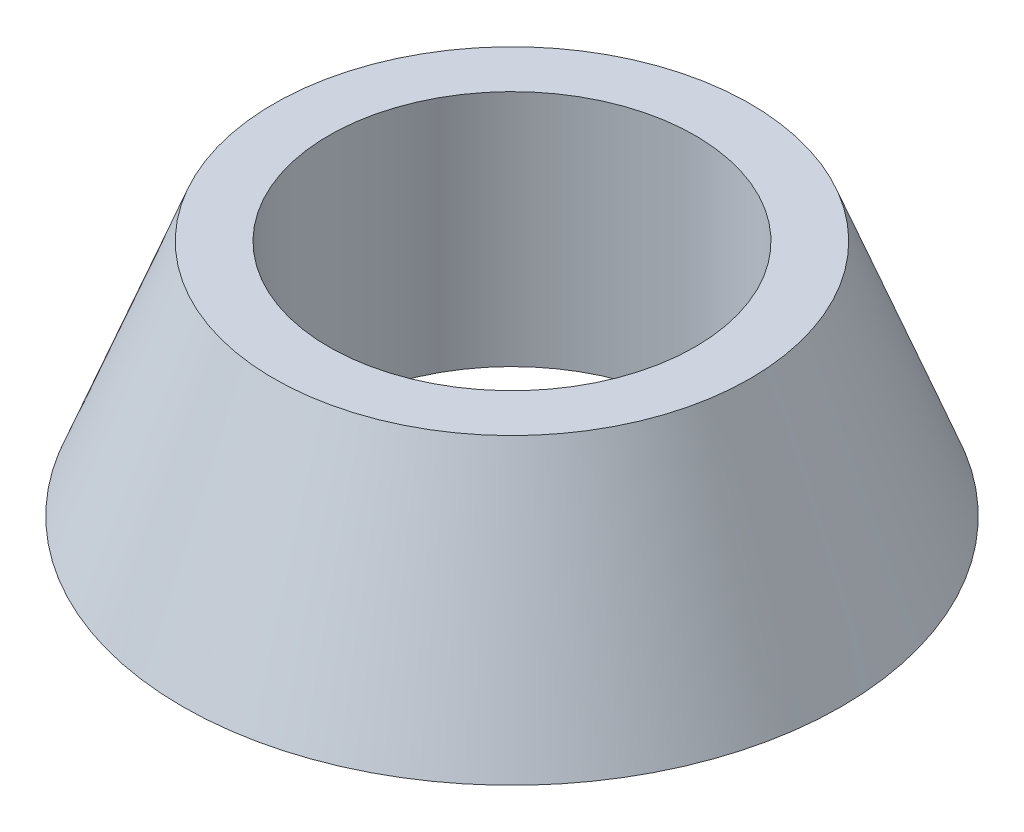
ISO-10303-21;
HEADER;
FILE_DESCRIPTION(('STEP AP214'),'2;1');
FILE_NAME('part.step','',(''),(''),'','','');
FILE_SCHEMA(('AUTOMOTIVE_DESIGN { 1 0 10303 214 1 1 1 1 }'));
ENDSEC;
DATA;
#1=APPLICATION_CONTEXT('core data for automotive mechanical design processes');
#2=APPLICATION_PROTOCOL_DEFINITION('international standard','automotive_design',2000,#1);
#3=PRODUCT_CONTEXT('',#1,'mechanical');
#4=PRODUCT('Part','Part','',(#3));
#5=PRODUCT_RELATED_PRODUCT_CATEGORY('part','',(#4));
#6=PRODUCT_DEFINITION_FORMATION('','',#4);
#7=PRODUCT_DEFINITION_CONTEXT('part definition',#1,'design');
#8=PRODUCT_DEFINITION('design','',#6,#7);
#9=PRODUCT_DEFINITION_SHAPE('','',#8);
#10=(LENGTH_UNIT() NAMED_UNIT(*) SI_UNIT(.MILLI.,.METRE.));
#11=(NAMED_UNIT(*) PLANE_ANGLE_UNIT() SI_UNIT($,.RADIAN.));
#12=(NAMED_UNIT(*) SI_UNIT($,.STERADIAN.) SOLID_ANGLE_UNIT());
#13=UNCERTAINTY_MEASURE_WITH_UNIT(LENGTH_MEASURE(1.E-05),#10,'distance_accuracy_value','');
#14=(GEOMETRIC_REPRESENTATION_CONTEXT(3) GLOBAL_UNCERTAINTY_ASSIGNED_CONTEXT((#13)) GLOBAL_UNIT_ASSIGNED_CONTEXT((#10,
#11,#12)) REPRESENTATION_CONTEXT('',''));
#15=CARTESIAN_POINT('',(0.,0.,0.));
#16=DIRECTION('',(0.,0.,1.));
#17=DIRECTION('',(1.,0.,0.));
#18=AXIS2_PLACEMENT_3D('',#15,#16,#17);
#19=CARTESIAN_POINT('',(9.,0.,0.));
#20=DIRECTION('',(0.,-1.,0.));
#21=DIRECTION('',(1.,0.,0.));
#22=AXIS2_PLACEMENT_3D('',#19,#20,#21);
#23=PLANE('',#22);
#24=CARTESIAN_POINT('',(0.,0.,0.));
#25=DIRECTION('',(0.,-1.,0.));
#26=DIRECTION('',(1.,0.,0.));
#27=AXIS2_PLACEMENT_3D('',#24,#25,#26);
#28=CIRCLE('',#27,9.);
#29=CARTESIAN_POINT('',(9.,0.,0.));
#30=VERTEX_POINT('',#29);
#31=EDGE_CURVE('E46',#30,#30,#28,.T.);
#32=ORIENTED_EDGE('',*,*,#31,.T.);
#33=EDGE_LOOP('',(#32));
#34=FACE_BOUND('',#33,.T.);
#35=CARTESIAN_POINT('',(0.,0.,0.));
#36=DIRECTION('',(0.,-1.,0.));
#37=DIRECTION('',(1.,0.,0.));
#38=AXIS2_PLACEMENT_3D('',#35,#36,#37);
#39=CIRCLE('',#38,5.);
#40=CARTESIAN_POINT('',(5.,0.,0.));
#41=VERTEX_POINT('',#40);
#42=EDGE_CURVE('E10',#41,#41,#39,.T.);
#43=ORIENTED_EDGE('',*,*,#42,.F.);
#44=EDGE_LOOP('',(#43));
#45=FACE_BOUND('',#44,.T.);
#46=ADVANCED_FACE('F32',(#34,#45),#23,.T.);
#47=CARTESIAN_POINT('',(0.,0.,0.));
#48=DIRECTION('',(0.,-1.,0.));
#49=DIRECTION('',(1.,0.,0.));
#50=AXIS2_PLACEMENT_3D('',#47,#48,#49);
#51=CYLINDRICAL_SURFACE('',#50,5.00000000000001);
#52=ORIENTED_EDGE('',*,*,#42,.T.);
#53=EDGE_LOOP('',(#52));
#54=FACE_BOUND('',#53,.T.);
#55=CARTESIAN_POINT('',(0.,6.49999999999998,0.));
#56=DIRECTION('',(0.,-1.,0.));
#57=DIRECTION('',(1.,0.,0.));
#58=AXIS2_PLACEMENT_3D('',#55,#56,#57);
#59=CIRCLE('',#58,5.00000000000002);
#60=CARTESIAN_POINT('',(5.,6.5,0.));
#61=VERTEX_POINT('',#60);
#62=EDGE_CURVE('E38',#61,#61,#59,.T.);
#63=ORIENTED_EDGE('',*,*,#62,.F.);
#64=EDGE_LOOP('',(#63));
#65=FACE_BOUND('',#64,.T.);
#66=ADVANCED_FACE('F62',(#54,#65),#51,.F.);
#67=CARTESIAN_POINT('',(5.,6.5,0.));
#68=DIRECTION('',(0.,1.,0.));
#69=DIRECTION('',(-1.,0.,0.));
#70=AXIS2_PLACEMENT_3D('',#67,#68,#69);
#71=PLANE('',#70);
#72=ORIENTED_EDGE('',*,*,#62,.T.);
#73=EDGE_LOOP('',(#72));
#74=FACE_BOUND('',#73,.T.);
#75=CARTESIAN_POINT('',(0.,6.49999999999998,0.));
#76=DIRECTION('',(0.,-1.,0.));
#77=DIRECTION('',(1.,0.,0.));
#78=AXIS2_PLACEMENT_3D('',#75,#76,#77);
#79=CIRCLE('',#78,6.50000000000002);
#80=CARTESIAN_POINT('',(6.5,6.5,0.));
#81=VERTEX_POINT('',#80);
#82=EDGE_CURVE('E42',#81,#81,#79,.T.);
#83=ORIENTED_EDGE('',*,*,#82,.F.);
#84=EDGE_LOOP('',(#83));
#85=FACE_BOUND('',#84,.T.);
#86=ADVANCED_FACE('F56',(#74,#85),#71,.T.);
#87=CARTESIAN_POINT('',(0.,0.,0.));
#88=DIRECTION('',(0.,-1.,0.));
#89=DIRECTION('',(1.,0.,0.));
#90=AXIS2_PLACEMENT_3D('',#87,#88,#89);
#91=CONICAL_SURFACE('',#90,9.,0.367173833818216);
#92=ORIENTED_EDGE('',*,*,#82,.T.);
#93=EDGE_LOOP('',(#92));
#94=FACE_BOUND('',#93,.T.);
#95=ORIENTED_EDGE('',*,*,#31,.F.);
#96=EDGE_LOOP('',(#95));
#97=FACE_BOUND('',#96,.T.);
#98=ADVANCED_FACE('F54',(#94,#97),#91,.T.);
#99=CLOSED_SHELL('',(#46,#66,#86,#98));
#100=MANIFOLD_SOLID_BREP('B2',#99);
#101=ADVANCED_BREP_SHAPE_REPRESENTATION('',(#18,#100),#14);
#102=SHAPE_DEFINITION_REPRESENTATION(#9,#101);
ENDSEC;
END-ISO-10303-21;
